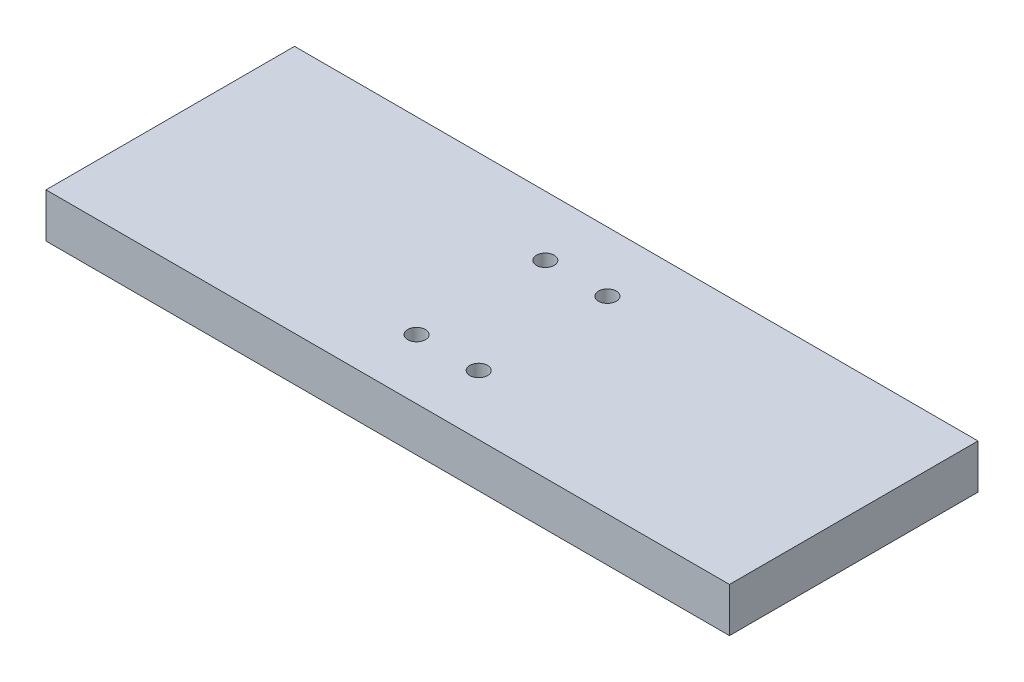
ISO-10303-21;
HEADER;
FILE_DESCRIPTION(('STEP AP214'),'2;1');
FILE_NAME('part.step','',(''),(''),'','','');
FILE_SCHEMA(('AUTOMOTIVE_DESIGN { 1 0 10303 214 1 1 1 1 }'));
ENDSEC;
DATA;
#1=APPLICATION_CONTEXT('core data for automotive mechanical design processes');
#2=APPLICATION_PROTOCOL_DEFINITION('international standard','automotive_design',2000,#1);
#3=PRODUCT_CONTEXT('',#1,'mechanical');
#4=PRODUCT('Part','Part','',(#3));
#5=PRODUCT_RELATED_PRODUCT_CATEGORY('part','',(#4));
#6=PRODUCT_DEFINITION_FORMATION('','',#4);
#7=PRODUCT_DEFINITION_CONTEXT('part definition',#1,'design');
#8=PRODUCT_DEFINITION('design','',#6,#7);
#9=PRODUCT_DEFINITION_SHAPE('','',#8);
#10=(LENGTH_UNIT() NAMED_UNIT(*) SI_UNIT(.MILLI.,.METRE.));
#11=(NAMED_UNIT(*) PLANE_ANGLE_UNIT() SI_UNIT($,.RADIAN.));
#12=(NAMED_UNIT(*) SI_UNIT($,.STERADIAN.) SOLID_ANGLE_UNIT());
#13=UNCERTAINTY_MEASURE_WITH_UNIT(LENGTH_MEASURE(1.E-05),#10,'distance_accuracy_value','');
#14=(GEOMETRIC_REPRESENTATION_CONTEXT(3) GLOBAL_UNCERTAINTY_ASSIGNED_CONTEXT((#13)) GLOBAL_UNIT_ASSIGNED_CONTEXT((#10,
#11,#12)) REPRESENTATION_CONTEXT('',''));
#15=CARTESIAN_POINT('',(0.,0.,0.));
#16=DIRECTION('',(0.,0.,1.));
#17=DIRECTION('',(1.,0.,0.));
#18=AXIS2_PLACEMENT_3D('',#15,#16,#17);
#19=CARTESIAN_POINT('',(-77.,10.,-28.));
#20=DIRECTION('',(1.,0.,0.));
#21=DIRECTION('',(0.,0.,-1.));
#22=AXIS2_PLACEMENT_3D('',#19,#20,#21);
#23=PLANE('',#22);
#24=DIRECTION('',(0.,0.,1.));
#25=VECTOR('',#24,1.);
#26=CARTESIAN_POINT('',(-77.,0.,-28.));
#27=LINE('',#26,#25);
#28=CARTESIAN_POINT('',(-77.,0.,-28.));
#29=VERTEX_POINT('',#28);
#30=CARTESIAN_POINT('',(-77.0000000000001,0.,28.));
#31=VERTEX_POINT('',#30);
#32=EDGE_CURVE('E147',#29,#31,#27,.T.);
#33=ORIENTED_EDGE('',*,*,#32,.T.);
#34=DIRECTION('',(0.,-1.,0.));
#35=VECTOR('',#34,1.);
#36=CARTESIAN_POINT('',(-77.0000000000001,10.,28.));
#37=LINE('',#36,#35);
#38=CARTESIAN_POINT('',(-77.0000000000001,10.,28.));
#39=VERTEX_POINT('',#38);
#40=EDGE_CURVE('E11',#39,#31,#37,.T.);
#41=ORIENTED_EDGE('',*,*,#40,.F.);
#42=DIRECTION('',(0.,0.,1.));
#43=VECTOR('',#42,1.);
#44=CARTESIAN_POINT('',(-77.,10.,-28.));
#45=LINE('',#44,#43);
#46=CARTESIAN_POINT('',(-77.,10.,-28.));
#47=VERTEX_POINT('',#46);
#48=EDGE_CURVE('E148',#47,#39,#45,.T.);
#49=ORIENTED_EDGE('',*,*,#48,.F.);
#50=DIRECTION('',(0.,-1.,0.));
#51=VECTOR('',#50,1.);
#52=CARTESIAN_POINT('',(-77.,10.,-28.));
#53=LINE('',#52,#51);
#54=EDGE_CURVE('E158',#47,#29,#53,.T.);
#55=ORIENTED_EDGE('',*,*,#54,.T.);
#56=EDGE_LOOP('',(#33,#41,#49,#55));
#57=FACE_BOUND('',#56,.T.);
#58=ADVANCED_FACE('F44',(#57),#23,.F.);
#59=CARTESIAN_POINT('',(77.,10.,28.));
#60=DIRECTION('',(0.,0.,-1.));
#61=DIRECTION('',(-1.,0.,0.));
#62=AXIS2_PLACEMENT_3D('',#59,#60,#61);
#63=PLANE('',#62);
#64=DIRECTION('',(1.,0.,0.));
#65=VECTOR('',#64,1.);
#66=CARTESIAN_POINT('',(77.,0.,28.));
#67=LINE('',#66,#65);
#68=CARTESIAN_POINT('',(77.,0.,28.));
#69=VERTEX_POINT('',#68);
#70=EDGE_CURVE('E162',#31,#69,#67,.T.);
#71=ORIENTED_EDGE('',*,*,#70,.T.);
#72=DIRECTION('',(0.,-1.,0.));
#73=VECTOR('',#72,1.);
#74=CARTESIAN_POINT('',(77.,10.,28.));
#75=LINE('',#74,#73);
#76=CARTESIAN_POINT('',(77.,10.,28.));
#77=VERTEX_POINT('',#76);
#78=EDGE_CURVE('E53',#77,#69,#75,.T.);
#79=ORIENTED_EDGE('',*,*,#78,.F.);
#80=DIRECTION('',(1.,0.,0.));
#81=VECTOR('',#80,1.);
#82=CARTESIAN_POINT('',(77.,10.,28.));
#83=LINE('',#82,#81);
#84=EDGE_CURVE('E92',#39,#77,#83,.T.);
#85=ORIENTED_EDGE('',*,*,#84,.F.);
#86=ORIENTED_EDGE('',*,*,#40,.T.);
#87=EDGE_LOOP('',(#71,#79,#85,#86));
#88=FACE_BOUND('',#87,.T.);
#89=ADVANCED_FACE('F193',(#88),#63,.F.);
#90=CARTESIAN_POINT('',(77.,10.,-28.));
#91=DIRECTION('',(-1.,0.,0.));
#92=DIRECTION('',(0.,0.,1.));
#93=AXIS2_PLACEMENT_3D('',#90,#91,#92);
#94=PLANE('',#93);
#95=DIRECTION('',(0.,0.,-1.));
#96=VECTOR('',#95,1.);
#97=CARTESIAN_POINT('',(77.,0.,-28.));
#98=LINE('',#97,#96);
#99=CARTESIAN_POINT('',(77.,0.,-28.));
#100=VERTEX_POINT('',#99);
#101=EDGE_CURVE('E79',#69,#100,#98,.T.);
#102=ORIENTED_EDGE('',*,*,#101,.T.);
#103=DIRECTION('',(0.,-1.,0.));
#104=VECTOR('',#103,1.);
#105=CARTESIAN_POINT('',(77.,10.,-28.));
#106=LINE('',#105,#104);
#107=CARTESIAN_POINT('',(77.,10.,-28.));
#108=VERTEX_POINT('',#107);
#109=EDGE_CURVE('E171',#108,#100,#106,.T.);
#110=ORIENTED_EDGE('',*,*,#109,.F.);
#111=DIRECTION('',(0.,0.,-1.));
#112=VECTOR('',#111,1.);
#113=CARTESIAN_POINT('',(77.,10.,-28.));
#114=LINE('',#113,#112);
#115=EDGE_CURVE('E153',#77,#108,#114,.T.);
#116=ORIENTED_EDGE('',*,*,#115,.F.);
#117=ORIENTED_EDGE('',*,*,#78,.T.);
#118=EDGE_LOOP('',(#102,#110,#116,#117));
#119=FACE_BOUND('',#118,.T.);
#120=ADVANCED_FACE('F176',(#119),#94,.F.);
#121=CARTESIAN_POINT('',(77.,10.,-28.));
#122=DIRECTION('',(0.,0.,1.));
#123=DIRECTION('',(1.,0.,0.));
#124=AXIS2_PLACEMENT_3D('',#121,#122,#123);
#125=PLANE('',#124);
#126=DIRECTION('',(-1.,0.,0.));
#127=VECTOR('',#126,1.);
#128=CARTESIAN_POINT('',(77.,0.,-28.));
#129=LINE('',#128,#127);
#130=EDGE_CURVE('E85',#100,#29,#129,.T.);
#131=ORIENTED_EDGE('',*,*,#130,.T.);
#132=ORIENTED_EDGE('',*,*,#54,.F.);
#133=DIRECTION('',(-1.,0.,0.));
#134=VECTOR('',#133,1.);
#135=CARTESIAN_POINT('',(77.,10.,-28.));
#136=LINE('',#135,#134);
#137=EDGE_CURVE('E61',#108,#47,#136,.T.);
#138=ORIENTED_EDGE('',*,*,#137,.F.);
#139=ORIENTED_EDGE('',*,*,#109,.T.);
#140=EDGE_LOOP('',(#131,#132,#138,#139));
#141=FACE_BOUND('',#140,.T.);
#142=ADVANCED_FACE('F183',(#141),#125,.F.);
#143=CARTESIAN_POINT('',(0.,10.,0.));
#144=DIRECTION('',(0.,-1.,0.));
#145=DIRECTION('',(0.,0.,-1.));
#146=AXIS2_PLACEMENT_3D('',#143,#144,#145);
#147=PLANE('',#146);
#148=CARTESIAN_POINT('',(-7.00000000000004,10.,-14.5));
#149=DIRECTION('',(0.,1.,0.));
#150=DIRECTION('',(0.,0.,1.));
#151=AXIS2_PLACEMENT_3D('',#148,#149,#150);
#152=CIRCLE('',#151,1.99999999999999);
#153=CARTESIAN_POINT('',(-7.00000000000004,10.,-12.5));
#154=VERTEX_POINT('',#153);
#155=EDGE_CURVE('E117',#154,#154,#152,.T.);
#156=ORIENTED_EDGE('',*,*,#155,.F.);
#157=EDGE_LOOP('',(#156));
#158=FACE_BOUND('',#157,.T.);
#159=CARTESIAN_POINT('',(-7.00000000000005,10.,14.5));
#160=DIRECTION('',(0.,1.,0.));
#161=DIRECTION('',(0.,0.,1.));
#162=AXIS2_PLACEMENT_3D('',#159,#160,#161);
#163=CIRCLE('',#162,1.99999999999999);
#164=CARTESIAN_POINT('',(-7.00000000000005,10.,16.5));
#165=VERTEX_POINT('',#164);
#166=EDGE_CURVE('E116',#165,#165,#163,.T.);
#167=ORIENTED_EDGE('',*,*,#166,.F.);
#168=EDGE_LOOP('',(#167));
#169=FACE_BOUND('',#168,.T.);
#170=CARTESIAN_POINT('',(6.99999999999996,10.,14.5));
#171=DIRECTION('',(0.,1.,0.));
#172=DIRECTION('',(0.,0.,1.));
#173=AXIS2_PLACEMENT_3D('',#170,#171,#172);
#174=CIRCLE('',#173,1.99999999999999);
#175=CARTESIAN_POINT('',(6.99999999999996,10.,16.5));
#176=VERTEX_POINT('',#175);
#177=EDGE_CURVE('E131',#176,#176,#174,.T.);
#178=ORIENTED_EDGE('',*,*,#177,.F.);
#179=EDGE_LOOP('',(#178));
#180=FACE_BOUND('',#179,.T.);
#181=CARTESIAN_POINT('',(6.99999999999996,10.,-14.5));
#182=DIRECTION('',(0.,1.,0.));
#183=DIRECTION('',(0.,0.,1.));
#184=AXIS2_PLACEMENT_3D('',#181,#182,#183);
#185=CIRCLE('',#184,1.99999999999999);
#186=CARTESIAN_POINT('',(6.99999999999996,10.,-12.5));
#187=VERTEX_POINT('',#186);
#188=EDGE_CURVE('E139',#187,#187,#185,.T.);
#189=ORIENTED_EDGE('',*,*,#188,.F.);
#190=EDGE_LOOP('',(#189));
#191=FACE_BOUND('',#190,.T.);
#192=ORIENTED_EDGE('',*,*,#48,.T.);
#193=ORIENTED_EDGE('',*,*,#84,.T.);
#194=ORIENTED_EDGE('',*,*,#115,.T.);
#195=ORIENTED_EDGE('',*,*,#137,.T.);
#196=EDGE_LOOP('',(#192,#193,#194,#195));
#197=FACE_BOUND('',#196,.T.);
#198=ADVANCED_FACE('F185',(#158,#169,#180,#191,#197),#147,.F.);
#199=CARTESIAN_POINT('',(0.,0.,0.));
#200=DIRECTION('',(0.,-1.,0.));
#201=DIRECTION('',(0.,0.,-1.));
#202=AXIS2_PLACEMENT_3D('',#199,#200,#201);
#203=PLANE('',#202);
#204=ORIENTED_EDGE('',*,*,#32,.F.);
#205=ORIENTED_EDGE('',*,*,#130,.F.);
#206=ORIENTED_EDGE('',*,*,#101,.F.);
#207=ORIENTED_EDGE('',*,*,#70,.F.);
#208=EDGE_LOOP('',(#204,#205,#206,#207));
#209=FACE_BOUND('',#208,.T.);
#210=ADVANCED_FACE('F179',(#209),#203,.T.);
#211=CARTESIAN_POINT('',(6.99999999999996,3.,-14.5));
#212=DIRECTION('',(0.,1.,0.));
#213=DIRECTION('',(0.,0.,1.));
#214=AXIS2_PLACEMENT_3D('',#211,#212,#213);
#215=CONICAL_SURFACE('',#214,2.,1.02974425867665);
#216=CARTESIAN_POINT('',(6.99999999999996,1.79827876194488,-14.5));
#217=VERTEX_POINT('',#216);
#218=VERTEX_LOOP('',#217);
#219=FACE_BOUND('',#218,.T.);
#220=CARTESIAN_POINT('',(6.99999999999996,3.,-14.5));
#221=DIRECTION('',(0.,1.,0.));
#222=DIRECTION('',(0.,0.,1.));
#223=AXIS2_PLACEMENT_3D('',#220,#221,#222);
#224=CIRCLE('',#223,2.);
#225=CARTESIAN_POINT('',(6.99999999999996,3.,-12.5));
#226=VERTEX_POINT('',#225);
#227=EDGE_CURVE('E143',#226,#226,#224,.T.);
#228=ORIENTED_EDGE('',*,*,#227,.T.);
#229=EDGE_LOOP('',(#228));
#230=FACE_BOUND('',#229,.T.);
#231=ADVANCED_FACE('F226',(#219,#230),#215,.F.);
#232=CARTESIAN_POINT('',(6.99999999999996,10.,-14.5));
#233=DIRECTION('',(0.,1.,0.));
#234=DIRECTION('',(0.,0.,1.));
#235=AXIS2_PLACEMENT_3D('',#232,#233,#234);
#236=CYLINDRICAL_SURFACE('',#235,1.99999999999999);
#237=ORIENTED_EDGE('',*,*,#227,.F.);
#238=EDGE_LOOP('',(#237));
#239=FACE_BOUND('',#238,.T.);
#240=ORIENTED_EDGE('',*,*,#188,.T.);
#241=EDGE_LOOP('',(#240));
#242=FACE_BOUND('',#241,.T.);
#243=ADVANCED_FACE('F233',(#239,#242),#236,.F.);
#244=CARTESIAN_POINT('',(6.99999999999996,3.,14.5));
#245=DIRECTION('',(0.,1.,0.));
#246=DIRECTION('',(0.,0.,1.));
#247=AXIS2_PLACEMENT_3D('',#244,#245,#246);
#248=CONICAL_SURFACE('',#247,2.,1.02974425867665);
#249=CARTESIAN_POINT('',(6.99999999999995,1.79827876194488,14.5));
#250=VERTEX_POINT('',#249);
#251=VERTEX_LOOP('',#250);
#252=FACE_BOUND('',#251,.T.);
#253=CARTESIAN_POINT('',(6.99999999999996,3.,14.5));
#254=DIRECTION('',(0.,1.,0.));
#255=DIRECTION('',(0.,0.,1.));
#256=AXIS2_PLACEMENT_3D('',#253,#254,#255);
#257=CIRCLE('',#256,2.);
#258=CARTESIAN_POINT('',(6.99999999999996,3.,16.5));
#259=VERTEX_POINT('',#258);
#260=EDGE_CURVE('E135',#259,#259,#257,.T.);
#261=ORIENTED_EDGE('',*,*,#260,.T.);
#262=EDGE_LOOP('',(#261));
#263=FACE_BOUND('',#262,.T.);
#264=ADVANCED_FACE('F244',(#252,#263),#248,.F.);
#265=CARTESIAN_POINT('',(6.99999999999996,10.,14.5));
#266=DIRECTION('',(0.,1.,0.));
#267=DIRECTION('',(0.,0.,1.));
#268=AXIS2_PLACEMENT_3D('',#265,#266,#267);
#269=CYLINDRICAL_SURFACE('',#268,1.99999999999999);
#270=ORIENTED_EDGE('',*,*,#260,.F.);
#271=EDGE_LOOP('',(#270));
#272=FACE_BOUND('',#271,.T.);
#273=ORIENTED_EDGE('',*,*,#177,.T.);
#274=EDGE_LOOP('',(#273));
#275=FACE_BOUND('',#274,.T.);
#276=ADVANCED_FACE('F256',(#272,#275),#269,.F.);
#277=CARTESIAN_POINT('',(-7.00000000000005,3.,14.5));
#278=DIRECTION('',(0.,1.,0.));
#279=DIRECTION('',(0.,0.,1.));
#280=AXIS2_PLACEMENT_3D('',#277,#278,#279);
#281=CONICAL_SURFACE('',#280,2.,1.02974425867665);
#282=CARTESIAN_POINT('',(-7.00000000000005,1.79827876194488,14.5));
#283=VERTEX_POINT('',#282);
#284=VERTEX_LOOP('',#283);
#285=FACE_BOUND('',#284,.T.);
#286=CARTESIAN_POINT('',(-7.00000000000005,3.,14.5));
#287=DIRECTION('',(0.,1.,0.));
#288=DIRECTION('',(0.,0.,1.));
#289=AXIS2_PLACEMENT_3D('',#286,#287,#288);
#290=CIRCLE('',#289,2.);
#291=CARTESIAN_POINT('',(-7.00000000000005,3.,16.5));
#292=VERTEX_POINT('',#291);
#293=EDGE_CURVE('E123',#292,#292,#290,.T.);
#294=ORIENTED_EDGE('',*,*,#293,.T.);
#295=EDGE_LOOP('',(#294));
#296=FACE_BOUND('',#295,.T.);
#297=ADVANCED_FACE('F266',(#285,#296),#281,.F.);
#298=CARTESIAN_POINT('',(-7.00000000000005,10.,14.5));
#299=DIRECTION('',(0.,1.,0.));
#300=DIRECTION('',(0.,0.,1.));
#301=AXIS2_PLACEMENT_3D('',#298,#299,#300);
#302=CYLINDRICAL_SURFACE('',#301,1.99999999999999);
#303=ORIENTED_EDGE('',*,*,#293,.F.);
#304=EDGE_LOOP('',(#303));
#305=FACE_BOUND('',#304,.T.);
#306=ORIENTED_EDGE('',*,*,#166,.T.);
#307=EDGE_LOOP('',(#306));
#308=FACE_BOUND('',#307,.T.);
#309=ADVANCED_FACE('F109',(#305,#308),#302,.F.);
#310=CARTESIAN_POINT('',(-7.00000000000004,3.,-14.5));
#311=DIRECTION('',(0.,1.,0.));
#312=DIRECTION('',(0.,0.,1.));
#313=AXIS2_PLACEMENT_3D('',#310,#311,#312);
#314=CONICAL_SURFACE('',#313,2.,1.02974425867665);
#315=CARTESIAN_POINT('',(-7.00000000000004,1.79827876194488,-14.5));
#316=VERTEX_POINT('',#315);
#317=VERTEX_LOOP('',#316);
#318=FACE_BOUND('',#317,.T.);
#319=CARTESIAN_POINT('',(-7.00000000000004,3.,-14.5));
#320=DIRECTION('',(0.,1.,0.));
#321=DIRECTION('',(0.,0.,1.));
#322=AXIS2_PLACEMENT_3D('',#319,#320,#321);
#323=CIRCLE('',#322,2.);
#324=CARTESIAN_POINT('',(-7.00000000000004,3.,-12.5));
#325=VERTEX_POINT('',#324);
#326=EDGE_CURVE('E113',#325,#325,#323,.T.);
#327=ORIENTED_EDGE('',*,*,#326,.T.);
#328=EDGE_LOOP('',(#327));
#329=FACE_BOUND('',#328,.T.);
#330=ADVANCED_FACE('F105',(#318,#329),#314,.F.);
#331=CARTESIAN_POINT('',(-7.00000000000004,10.,-14.5));
#332=DIRECTION('',(0.,1.,0.));
#333=DIRECTION('',(0.,0.,1.));
#334=AXIS2_PLACEMENT_3D('',#331,#332,#333);
#335=CYLINDRICAL_SURFACE('',#334,1.99999999999999);
#336=ORIENTED_EDGE('',*,*,#326,.F.);
#337=EDGE_LOOP('',(#336));
#338=FACE_BOUND('',#337,.T.);
#339=ORIENTED_EDGE('',*,*,#155,.T.);
#340=EDGE_LOOP('',(#339));
#341=FACE_BOUND('',#340,.T.);
#342=ADVANCED_FACE('F108',(#338,#341),#335,.F.);
#343=CLOSED_SHELL('',(#58,#89,#120,#142,#198,#210,#231,#243,#264,#276,#297,#309,#330,#342));
#344=MANIFOLD_SOLID_BREP('B2',#343);
#345=ADVANCED_BREP_SHAPE_REPRESENTATION('',(#18,#344),#14);
#346=SHAPE_DEFINITION_REPRESENTATION(#9,#345);
ENDSEC;
END-ISO-10303-21;
